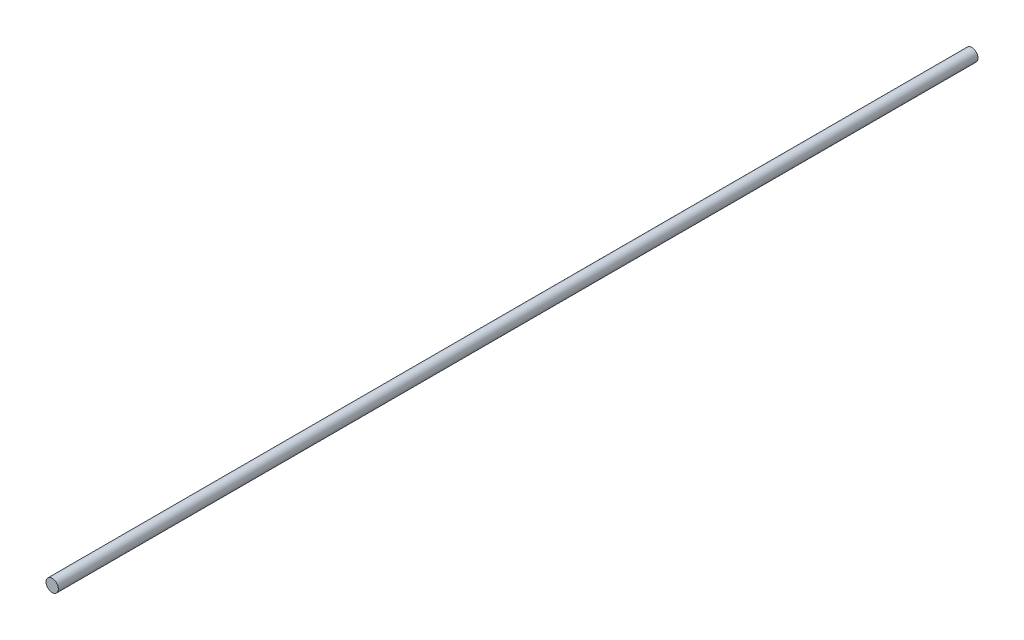
ISO-10303-21;
HEADER;
FILE_DESCRIPTION(('STEP AP214'),'2;1');
FILE_NAME('part.step','',(''),(''),'','','');
FILE_SCHEMA(('AUTOMOTIVE_DESIGN { 1 0 10303 214 1 1 1 1 }'));
ENDSEC;
DATA;
#1=APPLICATION_CONTEXT('core data for automotive mechanical design processes');
#2=APPLICATION_PROTOCOL_DEFINITION('international standard','automotive_design',2000,#1);
#3=PRODUCT_CONTEXT('',#1,'mechanical');
#4=PRODUCT('Part','Part','',(#3));
#5=PRODUCT_RELATED_PRODUCT_CATEGORY('part','',(#4));
#6=PRODUCT_DEFINITION_FORMATION('','',#4);
#7=PRODUCT_DEFINITION_CONTEXT('part definition',#1,'design');
#8=PRODUCT_DEFINITION('design','',#6,#7);
#9=PRODUCT_DEFINITION_SHAPE('','',#8);
#10=(LENGTH_UNIT() NAMED_UNIT(*) SI_UNIT(.MILLI.,.METRE.));
#11=(NAMED_UNIT(*) PLANE_ANGLE_UNIT() SI_UNIT($,.RADIAN.));
#12=(NAMED_UNIT(*) SI_UNIT($,.STERADIAN.) SOLID_ANGLE_UNIT());
#13=UNCERTAINTY_MEASURE_WITH_UNIT(LENGTH_MEASURE(1.E-05),#10,'distance_accuracy_value','');
#14=(GEOMETRIC_REPRESENTATION_CONTEXT(3) GLOBAL_UNCERTAINTY_ASSIGNED_CONTEXT((#13)) GLOBAL_UNIT_ASSIGNED_CONTEXT((#10,
#11,#12)) REPRESENTATION_CONTEXT('',''));
#15=CARTESIAN_POINT('',(0.,0.,0.));
#16=DIRECTION('',(0.,0.,1.));
#17=DIRECTION('',(1.,0.,0.));
#18=AXIS2_PLACEMENT_3D('',#15,#16,#17);
#19=CARTESIAN_POINT('',(0.,0.,472.435));
#20=DIRECTION('',(0.,0.,-1.));
#21=DIRECTION('',(-1.,0.,0.));
#22=AXIS2_PLACEMENT_3D('',#19,#20,#21);
#23=CYLINDRICAL_SURFACE('',#22,3.175);
#24=CARTESIAN_POINT('',(0.,0.,472.435));
#25=DIRECTION('',(0.,0.,1.));
#26=DIRECTION('',(1.,0.,0.));
#27=AXIS2_PLACEMENT_3D('',#24,#25,#26);
#28=CIRCLE('',#27,3.175);
#29=CARTESIAN_POINT('',(3.175,0.,472.435));
#30=VERTEX_POINT('',#29);
#31=EDGE_CURVE('E10',#30,#30,#28,.T.);
#32=ORIENTED_EDGE('',*,*,#31,.F.);
#33=EDGE_LOOP('',(#32));
#34=FACE_BOUND('',#33,.T.);
#35=CARTESIAN_POINT('',(0.,0.,0.));
#36=DIRECTION('',(0.,0.,1.));
#37=DIRECTION('',(1.,0.,0.));
#38=AXIS2_PLACEMENT_3D('',#35,#36,#37);
#39=CIRCLE('',#38,3.175);
#40=CARTESIAN_POINT('',(3.175,0.,0.));
#41=VERTEX_POINT('',#40);
#42=EDGE_CURVE('E38',#41,#41,#39,.T.);
#43=ORIENTED_EDGE('',*,*,#42,.T.);
#44=EDGE_LOOP('',(#43));
#45=FACE_BOUND('',#44,.T.);
#46=ADVANCED_FACE('F35',(#34,#45),#23,.T.);
#47=CARTESIAN_POINT('',(0.,0.,472.435));
#48=DIRECTION('',(0.,0.,1.));
#49=DIRECTION('',(1.,0.,0.));
#50=AXIS2_PLACEMENT_3D('',#47,#48,#49);
#51=PLANE('',#50);
#52=ORIENTED_EDGE('',*,*,#31,.T.);
#53=EDGE_LOOP('',(#52));
#54=FACE_BOUND('',#53,.T.);
#55=ADVANCED_FACE('F50',(#54),#51,.T.);
#56=CARTESIAN_POINT('',(0.,0.,0.));
#57=DIRECTION('',(0.,0.,1.));
#58=DIRECTION('',(1.,0.,0.));
#59=AXIS2_PLACEMENT_3D('',#56,#57,#58);
#60=PLANE('',#59);
#61=ORIENTED_EDGE('',*,*,#42,.F.);
#62=EDGE_LOOP('',(#61));
#63=FACE_BOUND('',#62,.T.);
#64=ADVANCED_FACE('F48',(#63),#60,.F.);
#65=CLOSED_SHELL('',(#46,#55,#64));
#66=MANIFOLD_SOLID_BREP('B2',#65);
#67=ADVANCED_BREP_SHAPE_REPRESENTATION('',(#18,#66),#14);
#68=SHAPE_DEFINITION_REPRESENTATION(#9,#67);
ENDSEC;
END-ISO-10303-21;
